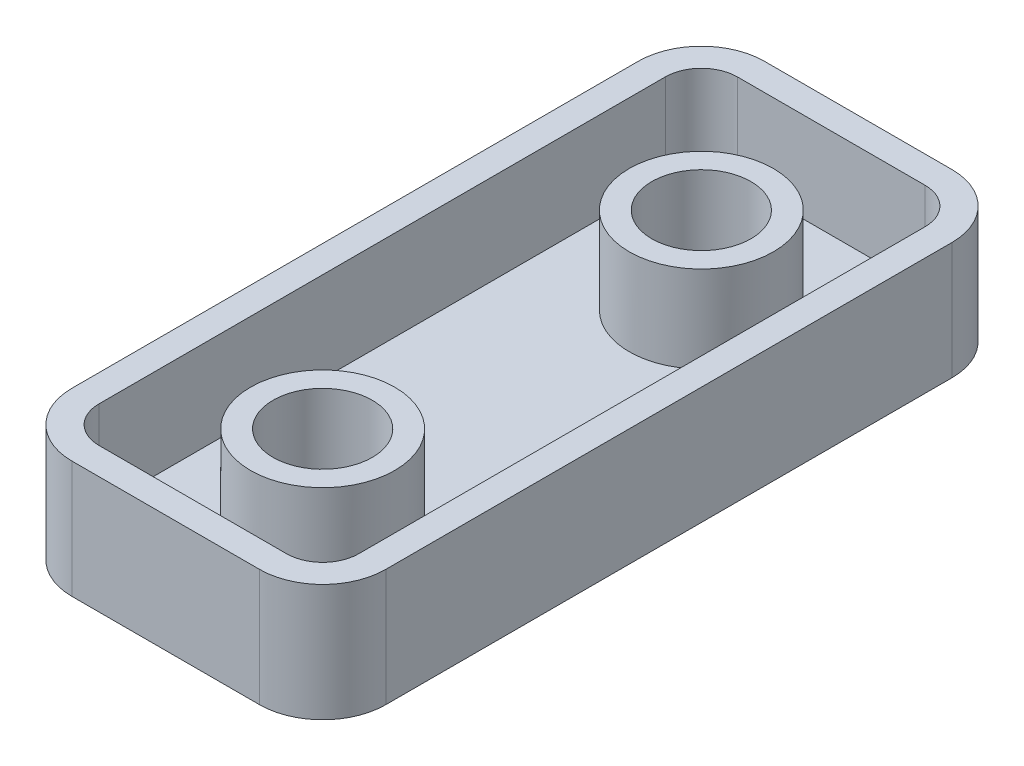
ISO-10303-21;
HEADER;
FILE_DESCRIPTION(('STEP AP214'),'2;1');
FILE_NAME('part.step','',(''),(''),'','','');
FILE_SCHEMA(('AUTOMOTIVE_DESIGN { 1 0 10303 214 1 1 1 1 }'));
ENDSEC;
DATA;
#1=APPLICATION_CONTEXT('core data for automotive mechanical design processes');
#2=APPLICATION_PROTOCOL_DEFINITION('international standard','automotive_design',2000,#1);
#3=PRODUCT_CONTEXT('',#1,'mechanical');
#4=PRODUCT('Part','Part','',(#3));
#5=PRODUCT_RELATED_PRODUCT_CATEGORY('part','',(#4));
#6=PRODUCT_DEFINITION_FORMATION('','',#4);
#7=PRODUCT_DEFINITION_CONTEXT('part definition',#1,'design');
#8=PRODUCT_DEFINITION('design','',#6,#7);
#9=PRODUCT_DEFINITION_SHAPE('','',#8);
#10=(LENGTH_UNIT() NAMED_UNIT(*) SI_UNIT(.MILLI.,.METRE.));
#11=(NAMED_UNIT(*) PLANE_ANGLE_UNIT() SI_UNIT($,.RADIAN.));
#12=(NAMED_UNIT(*) SI_UNIT($,.STERADIAN.) SOLID_ANGLE_UNIT());
#13=UNCERTAINTY_MEASURE_WITH_UNIT(LENGTH_MEASURE(1.E-05),#10,'distance_accuracy_value','');
#14=(GEOMETRIC_REPRESENTATION_CONTEXT(3) GLOBAL_UNCERTAINTY_ASSIGNED_CONTEXT((#13)) GLOBAL_UNIT_ASSIGNED_CONTEXT((#10,
#11,#12)) REPRESENTATION_CONTEXT('',''));
#15=CARTESIAN_POINT('',(0.,0.,0.));
#16=DIRECTION('',(0.,0.,1.));
#17=DIRECTION('',(1.,0.,0.));
#18=AXIS2_PLACEMENT_3D('',#15,#16,#17);
#19=CARTESIAN_POINT('',(0.,6.5,0.));
#20=DIRECTION('',(-1.,0.,0.));
#21=DIRECTION('',(0.,0.,1.));
#22=AXIS2_PLACEMENT_3D('',#19,#20,#21);
#23=PLANE('',#22);
#24=DIRECTION('',(0.,0.,-1.));
#25=VECTOR('',#24,1.);
#26=CARTESIAN_POINT('',(0.,0.,0.));
#27=LINE('',#26,#25);
#28=CARTESIAN_POINT('',(0.,0.,34.9));
#29=VERTEX_POINT('',#28);
#30=CARTESIAN_POINT('',(0.,0.,3.5));
#31=VERTEX_POINT('',#30);
#32=EDGE_CURVE('E219',#29,#31,#27,.T.);
#33=ORIENTED_EDGE('',*,*,#32,.T.);
#34=DIRECTION('',(0.,-1.,0.));
#35=VECTOR('',#34,1.);
#36=CARTESIAN_POINT('',(0.,6.5,3.5));
#37=LINE('',#36,#35);
#38=CARTESIAN_POINT('',(0.,6.5,3.5));
#39=VERTEX_POINT('',#38);
#40=EDGE_CURVE('E285',#31,#39,#37,.F.);
#41=ORIENTED_EDGE('',*,*,#40,.T.);
#42=DIRECTION('',(0.,0.,-1.));
#43=VECTOR('',#42,1.);
#44=CARTESIAN_POINT('',(0.,6.5,0.));
#45=LINE('',#44,#43);
#46=CARTESIAN_POINT('',(0.,6.5,34.9));
#47=VERTEX_POINT('',#46);
#48=EDGE_CURVE('E231',#47,#39,#45,.T.);
#49=ORIENTED_EDGE('',*,*,#48,.F.);
#50=DIRECTION('',(0.,-1.,0.));
#51=VECTOR('',#50,1.);
#52=CARTESIAN_POINT('',(0.,6.5,34.9));
#53=LINE('',#52,#51);
#54=EDGE_CURVE('E282',#47,#29,#53,.T.);
#55=ORIENTED_EDGE('',*,*,#54,.T.);
#56=EDGE_LOOP('',(#33,#41,#49,#55));
#57=FACE_BOUND('',#56,.T.);
#58=ADVANCED_FACE('F42',(#57),#23,.F.);
#59=CARTESIAN_POINT('',(0.,6.5,0.));
#60=DIRECTION('',(0.,0.,1.));
#61=DIRECTION('',(1.,0.,0.));
#62=AXIS2_PLACEMENT_3D('',#59,#60,#61);
#63=PLANE('',#62);
#64=DIRECTION('',(-1.,0.,0.));
#65=VECTOR('',#64,1.);
#66=CARTESIAN_POINT('',(0.,0.,0.));
#67=LINE('',#66,#65);
#68=CARTESIAN_POINT('',(-3.5,0.,0.));
#69=VERTEX_POINT('',#68);
#70=CARTESIAN_POINT('',(-13.9,0.,0.));
#71=VERTEX_POINT('',#70);
#72=EDGE_CURVE('E246',#69,#71,#67,.T.);
#73=ORIENTED_EDGE('',*,*,#72,.T.);
#74=DIRECTION('',(0.,-1.,0.));
#75=VECTOR('',#74,1.);
#76=CARTESIAN_POINT('',(-13.9,6.5,0.));
#77=LINE('',#76,#75);
#78=CARTESIAN_POINT('',(-13.9,6.5,0.));
#79=VERTEX_POINT('',#78);
#80=EDGE_CURVE('E65',#71,#79,#77,.F.);
#81=ORIENTED_EDGE('',*,*,#80,.T.);
#82=DIRECTION('',(-1.,0.,0.));
#83=VECTOR('',#82,1.);
#84=CARTESIAN_POINT('',(0.,6.5,0.));
#85=LINE('',#84,#83);
#86=CARTESIAN_POINT('',(-3.5,6.5,0.));
#87=VERTEX_POINT('',#86);
#88=EDGE_CURVE('E234',#87,#79,#85,.T.);
#89=ORIENTED_EDGE('',*,*,#88,.F.);
#90=DIRECTION('',(0.,-1.,0.));
#91=VECTOR('',#90,1.);
#92=CARTESIAN_POINT('',(-3.5,6.5,0.));
#93=LINE('',#92,#91);
#94=EDGE_CURVE('E278',#87,#69,#93,.T.);
#95=ORIENTED_EDGE('',*,*,#94,.T.);
#96=EDGE_LOOP('',(#73,#81,#89,#95));
#97=FACE_BOUND('',#96,.T.);
#98=ADVANCED_FACE('F306',(#97),#63,.F.);
#99=CARTESIAN_POINT('',(-17.4,6.5,0.));
#100=DIRECTION('',(1.,0.,0.));
#101=DIRECTION('',(0.,0.,-1.));
#102=AXIS2_PLACEMENT_3D('',#99,#100,#101);
#103=PLANE('',#102);
#104=DIRECTION('',(0.,0.,1.));
#105=VECTOR('',#104,1.);
#106=CARTESIAN_POINT('',(-17.4,0.,0.));
#107=LINE('',#106,#105);
#108=CARTESIAN_POINT('',(-17.4,0.,3.5));
#109=VERTEX_POINT('',#108);
#110=CARTESIAN_POINT('',(-17.4,0.,34.9));
#111=VERTEX_POINT('',#110);
#112=EDGE_CURVE('E248',#109,#111,#107,.T.);
#113=ORIENTED_EDGE('',*,*,#112,.T.);
#114=DIRECTION('',(0.,-1.,0.));
#115=VECTOR('',#114,1.);
#116=CARTESIAN_POINT('',(-17.4,6.5,34.9));
#117=LINE('',#116,#115);
#118=CARTESIAN_POINT('',(-17.4,6.5,34.9));
#119=VERTEX_POINT('',#118);
#120=EDGE_CURVE('E268',#111,#119,#117,.F.);
#121=ORIENTED_EDGE('',*,*,#120,.T.);
#122=DIRECTION('',(0.,0.,1.));
#123=VECTOR('',#122,1.);
#124=CARTESIAN_POINT('',(-17.4,6.5,0.));
#125=LINE('',#124,#123);
#126=CARTESIAN_POINT('',(-17.4,6.5,3.5));
#127=VERTEX_POINT('',#126);
#128=EDGE_CURVE('E237',#127,#119,#125,.T.);
#129=ORIENTED_EDGE('',*,*,#128,.F.);
#130=DIRECTION('',(0.,-1.,0.));
#131=VECTOR('',#130,1.);
#132=CARTESIAN_POINT('',(-17.4,6.5,3.5));
#133=LINE('',#132,#131);
#134=EDGE_CURVE('E265',#127,#109,#133,.T.);
#135=ORIENTED_EDGE('',*,*,#134,.T.);
#136=EDGE_LOOP('',(#113,#121,#129,#135));
#137=FACE_BOUND('',#136,.T.);
#138=ADVANCED_FACE('F312',(#137),#103,.F.);
#139=CARTESIAN_POINT('',(0.,6.5,38.4));
#140=DIRECTION('',(0.,0.,-1.));
#141=DIRECTION('',(-1.,0.,0.));
#142=AXIS2_PLACEMENT_3D('',#139,#140,#141);
#143=PLANE('',#142);
#144=DIRECTION('',(1.,0.,0.));
#145=VECTOR('',#144,1.);
#146=CARTESIAN_POINT('',(0.,6.5,38.4));
#147=LINE('',#146,#145);
#148=CARTESIAN_POINT('',(-13.9,6.5,38.4));
#149=VERTEX_POINT('',#148);
#150=CARTESIAN_POINT('',(-3.5,6.5,38.4));
#151=VERTEX_POINT('',#150);
#152=EDGE_CURVE('E240',#149,#151,#147,.T.);
#153=ORIENTED_EDGE('',*,*,#152,.F.);
#154=DIRECTION('',(0.,-1.,0.));
#155=VECTOR('',#154,1.);
#156=CARTESIAN_POINT('',(-13.9,6.5,38.4));
#157=LINE('',#156,#155);
#158=CARTESIAN_POINT('',(-13.9,0.,38.4));
#159=VERTEX_POINT('',#158);
#160=EDGE_CURVE('E254',#149,#159,#157,.T.);
#161=ORIENTED_EDGE('',*,*,#160,.T.);
#162=DIRECTION('',(1.,0.,0.));
#163=VECTOR('',#162,1.);
#164=CARTESIAN_POINT('',(0.,0.,38.4));
#165=LINE('',#164,#163);
#166=CARTESIAN_POINT('',(-3.5,0.,38.4));
#167=VERTEX_POINT('',#166);
#168=EDGE_CURVE('E235',#159,#167,#165,.T.);
#169=ORIENTED_EDGE('',*,*,#168,.T.);
#170=DIRECTION('',(0.,-1.,0.));
#171=VECTOR('',#170,1.);
#172=CARTESIAN_POINT('',(-3.5,6.5,38.4));
#173=LINE('',#172,#171);
#174=EDGE_CURVE('E243',#167,#151,#173,.F.);
#175=ORIENTED_EDGE('',*,*,#174,.T.);
#176=EDGE_LOOP('',(#153,#161,#169,#175));
#177=FACE_BOUND('',#176,.T.);
#178=ADVANCED_FACE('F351',(#177),#143,.F.);
#179=CARTESIAN_POINT('',(0.,6.5,0.));
#180=DIRECTION('',(0.,-1.,0.));
#181=DIRECTION('',(0.,0.,-1.));
#182=AXIS2_PLACEMENT_3D('',#179,#180,#181);
#183=PLANE('',#182);
#184=DIRECTION('',(1.,0.,0.));
#185=VECTOR('',#184,1.);
#186=CARTESIAN_POINT('',(-13.9,6.5,36.9));
#187=LINE('',#186,#185);
#188=CARTESIAN_POINT('',(-13.9,6.5,36.9));
#189=VERTEX_POINT('',#188);
#190=CARTESIAN_POINT('',(-3.5,6.5,36.9));
#191=VERTEX_POINT('',#190);
#192=EDGE_CURVE('E201',#189,#191,#187,.T.);
#193=ORIENTED_EDGE('',*,*,#192,.F.);
#194=CARTESIAN_POINT('',(-13.9,6.5,34.9));
#195=DIRECTION('',(0.,1.,0.));
#196=DIRECTION('',(0.,0.,-1.));
#197=AXIS2_PLACEMENT_3D('',#194,#195,#196);
#198=CIRCLE('',#197,2.);
#199=CARTESIAN_POINT('',(-15.9,6.5,34.9));
#200=VERTEX_POINT('',#199);
#201=EDGE_CURVE('E57',#200,#189,#198,.T.);
#202=ORIENTED_EDGE('',*,*,#201,.F.);
#203=DIRECTION('',(0.,0.,1.));
#204=VECTOR('',#203,1.);
#205=CARTESIAN_POINT('',(-15.9,6.5,34.9));
#206=LINE('',#205,#204);
#207=CARTESIAN_POINT('',(-15.9,6.5,3.5));
#208=VERTEX_POINT('',#207);
#209=EDGE_CURVE('E178',#208,#200,#206,.T.);
#210=ORIENTED_EDGE('',*,*,#209,.F.);
#211=CARTESIAN_POINT('',(-13.9,6.5,3.5));
#212=DIRECTION('',(0.,1.,0.));
#213=DIRECTION('',(0.,0.,1.));
#214=AXIS2_PLACEMENT_3D('',#211,#212,#213);
#215=CIRCLE('',#214,2.);
#216=CARTESIAN_POINT('',(-13.9,6.5,1.5));
#217=VERTEX_POINT('',#216);
#218=EDGE_CURVE('E181',#217,#208,#215,.T.);
#219=ORIENTED_EDGE('',*,*,#218,.F.);
#220=DIRECTION('',(-1.,0.,0.));
#221=VECTOR('',#220,1.);
#222=CARTESIAN_POINT('',(-13.9,6.5,1.5));
#223=LINE('',#222,#221);
#224=CARTESIAN_POINT('',(-3.50000000000001,6.5,1.5));
#225=VERTEX_POINT('',#224);
#226=EDGE_CURVE('E212',#225,#217,#223,.T.);
#227=ORIENTED_EDGE('',*,*,#226,.F.);
#228=CARTESIAN_POINT('',(-3.5,6.5,3.5));
#229=DIRECTION('',(0.,1.,0.));
#230=DIRECTION('',(0.,0.,1.));
#231=AXIS2_PLACEMENT_3D('',#228,#229,#230);
#232=CIRCLE('',#231,2.);
#233=CARTESIAN_POINT('',(-1.5,6.5,3.50000000000001));
#234=VERTEX_POINT('',#233);
#235=EDGE_CURVE('E209',#234,#225,#232,.T.);
#236=ORIENTED_EDGE('',*,*,#235,.F.);
#237=DIRECTION('',(0.,0.,-1.));
#238=VECTOR('',#237,1.);
#239=CARTESIAN_POINT('',(-1.5,6.5,34.9));
#240=LINE('',#239,#238);
#241=CARTESIAN_POINT('',(-1.5,6.5,34.9));
#242=VERTEX_POINT('',#241);
#243=EDGE_CURVE('E206',#242,#234,#240,.T.);
#244=ORIENTED_EDGE('',*,*,#243,.F.);
#245=CARTESIAN_POINT('',(-3.5,6.5,34.9));
#246=DIRECTION('',(0.,1.,0.));
#247=DIRECTION('',(0.,0.,1.));
#248=AXIS2_PLACEMENT_3D('',#245,#246,#247);
#249=CIRCLE('',#248,2.);
#250=EDGE_CURVE('E203',#191,#242,#249,.T.);
#251=ORIENTED_EDGE('',*,*,#250,.F.);
#252=EDGE_LOOP('',(#193,#202,#210,#219,#227,#236,#244,#251));
#253=FACE_BOUND('',#252,.T.);
#254=ORIENTED_EDGE('',*,*,#128,.T.);
#255=CARTESIAN_POINT('',(-13.9,6.5,34.9));
#256=DIRECTION('',(0.,-1.,0.));
#257=DIRECTION('',(0.,0.,-1.));
#258=AXIS2_PLACEMENT_3D('',#255,#256,#257);
#259=CIRCLE('',#258,3.5);
#260=EDGE_CURVE('E276',#119,#149,#259,.F.);
#261=ORIENTED_EDGE('',*,*,#260,.T.);
#262=ORIENTED_EDGE('',*,*,#152,.T.);
#263=CARTESIAN_POINT('',(-3.5,6.5,34.9));
#264=DIRECTION('',(0.,-1.,0.));
#265=DIRECTION('',(0.,0.,-1.));
#266=AXIS2_PLACEMENT_3D('',#263,#264,#265);
#267=CIRCLE('',#266,3.5);
#268=EDGE_CURVE('E270',#151,#47,#267,.F.);
#269=ORIENTED_EDGE('',*,*,#268,.T.);
#270=ORIENTED_EDGE('',*,*,#48,.T.);
#271=CARTESIAN_POINT('',(-3.5,6.5,3.5));
#272=DIRECTION('',(0.,-1.,0.));
#273=DIRECTION('',(0.,0.,-1.));
#274=AXIS2_PLACEMENT_3D('',#271,#272,#273);
#275=CIRCLE('',#274,3.5);
#276=EDGE_CURVE('E272',#39,#87,#275,.F.);
#277=ORIENTED_EDGE('',*,*,#276,.T.);
#278=ORIENTED_EDGE('',*,*,#88,.T.);
#279=CARTESIAN_POINT('',(-13.9,6.5,3.5));
#280=DIRECTION('',(0.,-1.,0.));
#281=DIRECTION('',(0.,0.,-1.));
#282=AXIS2_PLACEMENT_3D('',#279,#280,#281);
#283=CIRCLE('',#282,3.5);
#284=EDGE_CURVE('E274',#79,#127,#283,.F.);
#285=ORIENTED_EDGE('',*,*,#284,.T.);
#286=EDGE_LOOP('',(#254,#261,#262,#269,#270,#277,#278,#285));
#287=FACE_BOUND('',#286,.T.);
#288=ADVANCED_FACE('F335',(#253,#287),#183,.F.);
#289=CARTESIAN_POINT('',(0.,0.,0.));
#290=DIRECTION('',(0.,-1.,0.));
#291=DIRECTION('',(0.,0.,-1.));
#292=AXIS2_PLACEMENT_3D('',#289,#290,#291);
#293=PLANE('',#292);
#294=ORIENTED_EDGE('',*,*,#168,.F.);
#295=CARTESIAN_POINT('',(-13.9,0.,34.9));
#296=DIRECTION('',(0.,-1.,0.));
#297=DIRECTION('',(0.,0.,-1.));
#298=AXIS2_PLACEMENT_3D('',#295,#296,#297);
#299=CIRCLE('',#298,3.5);
#300=EDGE_CURVE('E263',#159,#111,#299,.T.);
#301=ORIENTED_EDGE('',*,*,#300,.T.);
#302=ORIENTED_EDGE('',*,*,#112,.F.);
#303=CARTESIAN_POINT('',(-13.9,0.,3.5));
#304=DIRECTION('',(0.,-1.,0.));
#305=DIRECTION('',(0.,0.,-1.));
#306=AXIS2_PLACEMENT_3D('',#303,#304,#305);
#307=CIRCLE('',#306,3.5);
#308=EDGE_CURVE('E261',#109,#71,#307,.T.);
#309=ORIENTED_EDGE('',*,*,#308,.T.);
#310=ORIENTED_EDGE('',*,*,#72,.F.);
#311=CARTESIAN_POINT('',(-3.5,0.,3.5));
#312=DIRECTION('',(0.,-1.,0.));
#313=DIRECTION('',(0.,0.,-1.));
#314=AXIS2_PLACEMENT_3D('',#311,#312,#313);
#315=CIRCLE('',#314,3.5);
#316=EDGE_CURVE('E259',#69,#31,#315,.T.);
#317=ORIENTED_EDGE('',*,*,#316,.T.);
#318=ORIENTED_EDGE('',*,*,#32,.F.);
#319=CARTESIAN_POINT('',(-3.5,0.,34.9));
#320=DIRECTION('',(0.,-1.,0.));
#321=DIRECTION('',(0.,0.,-1.));
#322=AXIS2_PLACEMENT_3D('',#319,#320,#321);
#323=CIRCLE('',#322,3.5);
#324=EDGE_CURVE('E257',#29,#167,#323,.T.);
#325=ORIENTED_EDGE('',*,*,#324,.T.);
#326=EDGE_LOOP('',(#294,#301,#302,#309,#310,#317,#318,#325));
#327=FACE_BOUND('',#326,.T.);
#328=ADVANCED_FACE('F320',(#327),#293,.T.);
#329=CARTESIAN_POINT('',(-13.9,6.5,34.9));
#330=DIRECTION('',(0.,-1.,0.));
#331=DIRECTION('',(0.,0.,-1.));
#332=AXIS2_PLACEMENT_3D('',#329,#330,#331);
#333=CYLINDRICAL_SURFACE('',#332,3.5);
#334=ORIENTED_EDGE('',*,*,#260,.F.);
#335=ORIENTED_EDGE('',*,*,#120,.F.);
#336=ORIENTED_EDGE('',*,*,#300,.F.);
#337=ORIENTED_EDGE('',*,*,#160,.F.);
#338=EDGE_LOOP('',(#334,#335,#336,#337));
#339=FACE_BOUND('',#338,.T.);
#340=ADVANCED_FACE('F316',(#339),#333,.T.);
#341=CARTESIAN_POINT('',(-13.9,6.5,3.5));
#342=DIRECTION('',(0.,-1.,0.));
#343=DIRECTION('',(0.,0.,-1.));
#344=AXIS2_PLACEMENT_3D('',#341,#342,#343);
#345=CYLINDRICAL_SURFACE('',#344,3.5);
#346=ORIENTED_EDGE('',*,*,#284,.F.);
#347=ORIENTED_EDGE('',*,*,#80,.F.);
#348=ORIENTED_EDGE('',*,*,#308,.F.);
#349=ORIENTED_EDGE('',*,*,#134,.F.);
#350=EDGE_LOOP('',(#346,#347,#348,#349));
#351=FACE_BOUND('',#350,.T.);
#352=ADVANCED_FACE('F319',(#351),#345,.T.);
#353=CARTESIAN_POINT('',(-3.5,6.5,3.5));
#354=DIRECTION('',(0.,-1.,0.));
#355=DIRECTION('',(0.,0.,-1.));
#356=AXIS2_PLACEMENT_3D('',#353,#354,#355);
#357=CYLINDRICAL_SURFACE('',#356,3.5);
#358=ORIENTED_EDGE('',*,*,#276,.F.);
#359=ORIENTED_EDGE('',*,*,#40,.F.);
#360=ORIENTED_EDGE('',*,*,#316,.F.);
#361=ORIENTED_EDGE('',*,*,#94,.F.);
#362=EDGE_LOOP('',(#358,#359,#360,#361));
#363=FACE_BOUND('',#362,.T.);
#364=ADVANCED_FACE('F323',(#363),#357,.T.);
#365=CARTESIAN_POINT('',(-3.5,6.5,34.9));
#366=DIRECTION('',(0.,-1.,0.));
#367=DIRECTION('',(0.,0.,-1.));
#368=AXIS2_PLACEMENT_3D('',#365,#366,#367);
#369=CYLINDRICAL_SURFACE('',#368,3.5);
#370=ORIENTED_EDGE('',*,*,#268,.F.);
#371=ORIENTED_EDGE('',*,*,#174,.F.);
#372=ORIENTED_EDGE('',*,*,#324,.F.);
#373=ORIENTED_EDGE('',*,*,#54,.F.);
#374=EDGE_LOOP('',(#370,#371,#372,#373));
#375=FACE_BOUND('',#374,.T.);
#376=ADVANCED_FACE('F44',(#375),#369,.T.);
#377=CARTESIAN_POINT('',(-13.9,1.5,34.9));
#378=DIRECTION('',(0.,1.,0.));
#379=DIRECTION('',(0.,0.,1.));
#380=AXIS2_PLACEMENT_3D('',#377,#378,#379);
#381=CYLINDRICAL_SURFACE('',#380,2.);
#382=ORIENTED_EDGE('',*,*,#201,.T.);
#383=DIRECTION('',(0.,1.,0.));
#384=VECTOR('',#383,1.);
#385=CARTESIAN_POINT('',(-13.9,1.5,36.9));
#386=LINE('',#385,#384);
#387=CARTESIAN_POINT('',(-13.9,1.5,36.9));
#388=VERTEX_POINT('',#387);
#389=EDGE_CURVE('E155',#388,#189,#386,.T.);
#390=ORIENTED_EDGE('',*,*,#389,.F.);
#391=CARTESIAN_POINT('',(-13.9,1.5,34.9));
#392=DIRECTION('',(0.,1.,0.));
#393=DIRECTION('',(0.,0.,-1.));
#394=AXIS2_PLACEMENT_3D('',#391,#392,#393);
#395=CIRCLE('',#394,2.);
#396=CARTESIAN_POINT('',(-15.9,1.5,34.9));
#397=VERTEX_POINT('',#396);
#398=EDGE_CURVE('E159',#397,#388,#395,.T.);
#399=ORIENTED_EDGE('',*,*,#398,.F.);
#400=DIRECTION('',(0.,1.,0.));
#401=VECTOR('',#400,1.);
#402=CARTESIAN_POINT('',(-15.9,1.5,34.9));
#403=LINE('',#402,#401);
#404=EDGE_CURVE('E217',#397,#200,#403,.T.);
#405=ORIENTED_EDGE('',*,*,#404,.T.);
#406=EDGE_LOOP('',(#382,#390,#399,#405));
#407=FACE_BOUND('',#406,.T.);
#408=ADVANCED_FACE('F157',(#407),#381,.F.);
#409=CARTESIAN_POINT('',(-15.9,1.5,34.9));
#410=DIRECTION('',(-1.,0.,0.));
#411=DIRECTION('',(0.,0.,1.));
#412=AXIS2_PLACEMENT_3D('',#409,#410,#411);
#413=PLANE('',#412);
#414=ORIENTED_EDGE('',*,*,#209,.T.);
#415=ORIENTED_EDGE('',*,*,#404,.F.);
#416=DIRECTION('',(0.,0.,1.));
#417=VECTOR('',#416,1.);
#418=CARTESIAN_POINT('',(-15.9,1.5,34.9));
#419=LINE('',#418,#417);
#420=CARTESIAN_POINT('',(-15.9,1.5,3.5));
#421=VERTEX_POINT('',#420);
#422=EDGE_CURVE('E165',#421,#397,#419,.T.);
#423=ORIENTED_EDGE('',*,*,#422,.F.);
#424=DIRECTION('',(0.,1.,0.));
#425=VECTOR('',#424,1.);
#426=CARTESIAN_POINT('',(-15.9,1.5,3.5));
#427=LINE('',#426,#425);
#428=EDGE_CURVE('E220',#421,#208,#427,.T.);
#429=ORIENTED_EDGE('',*,*,#428,.T.);
#430=EDGE_LOOP('',(#414,#415,#423,#429));
#431=FACE_BOUND('',#430,.T.);
#432=ADVANCED_FACE('F367',(#431),#413,.F.);
#433=CARTESIAN_POINT('',(-13.9,1.5,3.5));
#434=DIRECTION('',(0.,1.,0.));
#435=DIRECTION('',(0.,0.,1.));
#436=AXIS2_PLACEMENT_3D('',#433,#434,#435);
#437=CYLINDRICAL_SURFACE('',#436,2.);
#438=ORIENTED_EDGE('',*,*,#218,.T.);
#439=ORIENTED_EDGE('',*,*,#428,.F.);
#440=CARTESIAN_POINT('',(-13.9,1.5,3.5));
#441=DIRECTION('',(0.,1.,0.));
#442=DIRECTION('',(0.,0.,1.));
#443=AXIS2_PLACEMENT_3D('',#440,#441,#442);
#444=CIRCLE('',#443,2.);
#445=CARTESIAN_POINT('',(-13.9,1.5,1.5));
#446=VERTEX_POINT('',#445);
#447=EDGE_CURVE('E197',#446,#421,#444,.T.);
#448=ORIENTED_EDGE('',*,*,#447,.F.);
#449=DIRECTION('',(0.,1.,0.));
#450=VECTOR('',#449,1.);
#451=CARTESIAN_POINT('',(-13.9,1.5,1.5));
#452=LINE('',#451,#450);
#453=EDGE_CURVE('E222',#446,#217,#452,.T.);
#454=ORIENTED_EDGE('',*,*,#453,.T.);
#455=EDGE_LOOP('',(#438,#439,#448,#454));
#456=FACE_BOUND('',#455,.T.);
#457=ADVANCED_FACE('F383',(#456),#437,.F.);
#458=CARTESIAN_POINT('',(-13.9,1.5,1.5));
#459=DIRECTION('',(0.,0.,-1.));
#460=DIRECTION('',(-1.,0.,0.));
#461=AXIS2_PLACEMENT_3D('',#458,#459,#460);
#462=PLANE('',#461);
#463=ORIENTED_EDGE('',*,*,#226,.T.);
#464=ORIENTED_EDGE('',*,*,#453,.F.);
#465=DIRECTION('',(-1.,0.,0.));
#466=VECTOR('',#465,1.);
#467=CARTESIAN_POINT('',(-13.9,1.5,1.5));
#468=LINE('',#467,#466);
#469=CARTESIAN_POINT('',(-3.50000000000001,1.5,1.5));
#470=VERTEX_POINT('',#469);
#471=EDGE_CURVE('E194',#470,#446,#468,.T.);
#472=ORIENTED_EDGE('',*,*,#471,.F.);
#473=DIRECTION('',(0.,1.,0.));
#474=VECTOR('',#473,1.);
#475=CARTESIAN_POINT('',(-3.50000000000001,1.5,1.5));
#476=LINE('',#475,#474);
#477=EDGE_CURVE('E224',#470,#225,#476,.T.);
#478=ORIENTED_EDGE('',*,*,#477,.T.);
#479=EDGE_LOOP('',(#463,#464,#472,#478));
#480=FACE_BOUND('',#479,.T.);
#481=ADVANCED_FACE('F379',(#480),#462,.F.);
#482=CARTESIAN_POINT('',(-3.5,1.5,3.5));
#483=DIRECTION('',(0.,1.,0.));
#484=DIRECTION('',(0.,0.,1.));
#485=AXIS2_PLACEMENT_3D('',#482,#483,#484);
#486=CYLINDRICAL_SURFACE('',#485,2.);
#487=ORIENTED_EDGE('',*,*,#235,.T.);
#488=ORIENTED_EDGE('',*,*,#477,.F.);
#489=CARTESIAN_POINT('',(-3.5,1.5,3.5));
#490=DIRECTION('',(0.,1.,0.));
#491=DIRECTION('',(0.,0.,1.));
#492=AXIS2_PLACEMENT_3D('',#489,#490,#491);
#493=CIRCLE('',#492,2.);
#494=CARTESIAN_POINT('',(-1.5,1.5,3.50000000000001));
#495=VERTEX_POINT('',#494);
#496=EDGE_CURVE('E191',#495,#470,#493,.T.);
#497=ORIENTED_EDGE('',*,*,#496,.F.);
#498=DIRECTION('',(0.,1.,0.));
#499=VECTOR('',#498,1.);
#500=CARTESIAN_POINT('',(-1.5,1.5,3.50000000000001));
#501=LINE('',#500,#499);
#502=EDGE_CURVE('E226',#495,#234,#501,.T.);
#503=ORIENTED_EDGE('',*,*,#502,.T.);
#504=EDGE_LOOP('',(#487,#488,#497,#503));
#505=FACE_BOUND('',#504,.T.);
#506=ADVANCED_FACE('F375',(#505),#486,.F.);
#507=CARTESIAN_POINT('',(-1.5,1.5,34.9));
#508=DIRECTION('',(1.,0.,0.));
#509=DIRECTION('',(0.,0.,-1.));
#510=AXIS2_PLACEMENT_3D('',#507,#508,#509);
#511=PLANE('',#510);
#512=ORIENTED_EDGE('',*,*,#243,.T.);
#513=ORIENTED_EDGE('',*,*,#502,.F.);
#514=DIRECTION('',(0.,0.,-1.));
#515=VECTOR('',#514,1.);
#516=CARTESIAN_POINT('',(-1.5,1.5,34.9));
#517=LINE('',#516,#515);
#518=CARTESIAN_POINT('',(-1.5,1.5,34.9));
#519=VERTEX_POINT('',#518);
#520=EDGE_CURVE('E188',#519,#495,#517,.T.);
#521=ORIENTED_EDGE('',*,*,#520,.F.);
#522=DIRECTION('',(0.,1.,0.));
#523=VECTOR('',#522,1.);
#524=CARTESIAN_POINT('',(-1.5,1.5,34.9));
#525=LINE('',#524,#523);
#526=EDGE_CURVE('E228',#519,#242,#525,.T.);
#527=ORIENTED_EDGE('',*,*,#526,.T.);
#528=EDGE_LOOP('',(#512,#513,#521,#527));
#529=FACE_BOUND('',#528,.T.);
#530=ADVANCED_FACE('F371',(#529),#511,.F.);
#531=CARTESIAN_POINT('',(-3.5,1.5,34.9));
#532=DIRECTION('',(0.,1.,0.));
#533=DIRECTION('',(0.,0.,1.));
#534=AXIS2_PLACEMENT_3D('',#531,#532,#533);
#535=CYLINDRICAL_SURFACE('',#534,2.);
#536=ORIENTED_EDGE('',*,*,#250,.T.);
#537=ORIENTED_EDGE('',*,*,#526,.F.);
#538=CARTESIAN_POINT('',(-3.5,1.5,34.9));
#539=DIRECTION('',(0.,1.,0.));
#540=DIRECTION('',(0.,0.,1.));
#541=AXIS2_PLACEMENT_3D('',#538,#539,#540);
#542=CIRCLE('',#541,2.);
#543=CARTESIAN_POINT('',(-3.5,1.5,36.9));
#544=VERTEX_POINT('',#543);
#545=EDGE_CURVE('E173',#544,#519,#542,.T.);
#546=ORIENTED_EDGE('',*,*,#545,.F.);
#547=DIRECTION('',(0.,1.,0.));
#548=VECTOR('',#547,1.);
#549=CARTESIAN_POINT('',(-3.5,1.5,36.9));
#550=LINE('',#549,#548);
#551=EDGE_CURVE('E164',#544,#191,#550,.T.);
#552=ORIENTED_EDGE('',*,*,#551,.T.);
#553=EDGE_LOOP('',(#536,#537,#546,#552));
#554=FACE_BOUND('',#553,.T.);
#555=ADVANCED_FACE('F301',(#554),#535,.F.);
#556=CARTESIAN_POINT('',(-13.9,1.5,36.9));
#557=DIRECTION('',(0.,0.,1.));
#558=DIRECTION('',(1.,0.,0.));
#559=AXIS2_PLACEMENT_3D('',#556,#557,#558);
#560=PLANE('',#559);
#561=ORIENTED_EDGE('',*,*,#192,.T.);
#562=ORIENTED_EDGE('',*,*,#551,.F.);
#563=DIRECTION('',(1.,0.,0.));
#564=VECTOR('',#563,1.);
#565=CARTESIAN_POINT('',(-13.9,1.5,36.9));
#566=LINE('',#565,#564);
#567=EDGE_CURVE('E168',#388,#544,#566,.T.);
#568=ORIENTED_EDGE('',*,*,#567,.F.);
#569=ORIENTED_EDGE('',*,*,#389,.T.);
#570=EDGE_LOOP('',(#561,#562,#568,#569));
#571=FACE_BOUND('',#570,.T.);
#572=ADVANCED_FACE('F169',(#571),#560,.F.);
#573=CARTESIAN_POINT('',(-13.9,1.5,34.9));
#574=DIRECTION('',(0.,-1.,0.));
#575=DIRECTION('',(0.,0.,-1.));
#576=AXIS2_PLACEMENT_3D('',#573,#574,#575);
#577=PLANE('',#576);
#578=CARTESIAN_POINT('',(-8.7,1.5,29.7));
#579=DIRECTION('',(0.,-1.,0.));
#580=DIRECTION('',(0.,0.,-1.));
#581=AXIS2_PLACEMENT_3D('',#578,#579,#580);
#582=CIRCLE('',#581,4.);
#583=CARTESIAN_POINT('',(-8.7,1.5,25.7));
#584=VERTEX_POINT('',#583);
#585=EDGE_CURVE('E11',#584,#584,#582,.F.);
#586=ORIENTED_EDGE('',*,*,#585,.F.);
#587=EDGE_LOOP('',(#586));
#588=FACE_BOUND('',#587,.T.);
#589=CARTESIAN_POINT('',(-8.7,1.5,8.7));
#590=DIRECTION('',(0.,-1.,0.));
#591=DIRECTION('',(0.,0.,-1.));
#592=AXIS2_PLACEMENT_3D('',#589,#590,#591);
#593=CIRCLE('',#592,4.);
#594=CARTESIAN_POINT('',(-8.7,1.5,4.69999999999999));
#595=VERTEX_POINT('',#594);
#596=EDGE_CURVE('E50',#595,#595,#593,.F.);
#597=ORIENTED_EDGE('',*,*,#596,.F.);
#598=EDGE_LOOP('',(#597));
#599=FACE_BOUND('',#598,.T.);
#600=ORIENTED_EDGE('',*,*,#398,.T.);
#601=ORIENTED_EDGE('',*,*,#567,.T.);
#602=ORIENTED_EDGE('',*,*,#545,.T.);
#603=ORIENTED_EDGE('',*,*,#520,.T.);
#604=ORIENTED_EDGE('',*,*,#496,.T.);
#605=ORIENTED_EDGE('',*,*,#471,.T.);
#606=ORIENTED_EDGE('',*,*,#447,.T.);
#607=ORIENTED_EDGE('',*,*,#422,.T.);
#608=EDGE_LOOP('',(#600,#601,#602,#603,#604,#605,#606,#607));
#609=FACE_BOUND('',#608,.T.);
#610=ADVANCED_FACE('F175',(#588,#599,#609),#577,.F.);
#611=CARTESIAN_POINT('',(-8.7,6.3,8.7));
#612=DIRECTION('',(0.,-1.,0.));
#613=DIRECTION('',(0.,0.,-1.));
#614=AXIS2_PLACEMENT_3D('',#611,#612,#613);
#615=CYLINDRICAL_SURFACE('',#614,2.75);
#616=CARTESIAN_POINT('',(-8.7,6.3,8.7));
#617=DIRECTION('',(0.,1.,0.));
#618=DIRECTION('',(0.,0.,1.));
#619=AXIS2_PLACEMENT_3D('',#616,#617,#618);
#620=CIRCLE('',#619,2.75);
#621=CARTESIAN_POINT('',(-8.7,6.3,11.45));
#622=VERTEX_POINT('',#621);
#623=EDGE_CURVE('E708',#622,#622,#620,.T.);
#624=ORIENTED_EDGE('',*,*,#623,.T.);
#625=EDGE_LOOP('',(#624));
#626=FACE_BOUND('',#625,.T.);
#627=CARTESIAN_POINT('',(-8.7,0.6,8.7));
#628=DIRECTION('',(0.,1.,0.));
#629=DIRECTION('',(0.,0.,1.));
#630=AXIS2_PLACEMENT_3D('',#627,#628,#629);
#631=CIRCLE('',#630,2.75);
#632=CARTESIAN_POINT('',(-8.7,0.6,11.45));
#633=VERTEX_POINT('',#632);
#634=EDGE_CURVE('E696',#633,#633,#631,.T.);
#635=ORIENTED_EDGE('',*,*,#634,.F.);
#636=EDGE_LOOP('',(#635));
#637=FACE_BOUND('',#636,.T.);
#638=ADVANCED_FACE('F292',(#626,#637),#615,.F.);
#639=CARTESIAN_POINT('',(-8.7,6.3,8.7));
#640=DIRECTION('',(0.,-1.,0.));
#641=DIRECTION('',(0.,0.,-1.));
#642=AXIS2_PLACEMENT_3D('',#639,#640,#641);
#643=CYLINDRICAL_SURFACE('',#642,4.);
#644=CARTESIAN_POINT('',(-8.7,6.3,8.7));
#645=DIRECTION('',(0.,1.,0.));
#646=DIRECTION('',(0.,0.,1.));
#647=AXIS2_PLACEMENT_3D('',#644,#645,#646);
#648=CIRCLE('',#647,4.);
#649=CARTESIAN_POINT('',(-8.7,6.3,12.7));
#650=VERTEX_POINT('',#649);
#651=EDGE_CURVE('E184',#650,#650,#648,.T.);
#652=ORIENTED_EDGE('',*,*,#651,.F.);
#653=EDGE_LOOP('',(#652));
#654=FACE_BOUND('',#653,.T.);
#655=ORIENTED_EDGE('',*,*,#596,.T.);
#656=EDGE_LOOP('',(#655));
#657=FACE_BOUND('',#656,.T.);
#658=ADVANCED_FACE('F289',(#654,#657),#643,.T.);
#659=CARTESIAN_POINT('',(0.,6.3,0.));
#660=DIRECTION('',(0.,1.,0.));
#661=DIRECTION('',(0.,0.,1.));
#662=AXIS2_PLACEMENT_3D('',#659,#660,#661);
#663=PLANE('',#662);
#664=ORIENTED_EDGE('',*,*,#623,.F.);
#665=EDGE_LOOP('',(#664));
#666=FACE_BOUND('',#665,.T.);
#667=ORIENTED_EDGE('',*,*,#651,.T.);
#668=EDGE_LOOP('',(#667));
#669=FACE_BOUND('',#668,.T.);
#670=ADVANCED_FACE('F448',(#666,#669),#663,.T.);
#671=CARTESIAN_POINT('',(-8.7,6.3,29.7));
#672=DIRECTION('',(0.,-1.,0.));
#673=DIRECTION('',(0.,0.,-1.));
#674=AXIS2_PLACEMENT_3D('',#671,#672,#673);
#675=CYLINDRICAL_SURFACE('',#674,2.75);
#676=CARTESIAN_POINT('',(-8.7,6.3,29.7));
#677=DIRECTION('',(0.,1.,0.));
#678=DIRECTION('',(0.,0.,1.));
#679=AXIS2_PLACEMENT_3D('',#676,#677,#678);
#680=CIRCLE('',#679,2.75);
#681=CARTESIAN_POINT('',(-8.7,6.3,32.45));
#682=VERTEX_POINT('',#681);
#683=EDGE_CURVE('E701',#682,#682,#680,.T.);
#684=ORIENTED_EDGE('',*,*,#683,.T.);
#685=EDGE_LOOP('',(#684));
#686=FACE_BOUND('',#685,.T.);
#687=CARTESIAN_POINT('',(-8.7,0.6,29.7));
#688=DIRECTION('',(0.,1.,0.));
#689=DIRECTION('',(0.,0.,1.));
#690=AXIS2_PLACEMENT_3D('',#687,#688,#689);
#691=CIRCLE('',#690,2.75);
#692=CARTESIAN_POINT('',(-8.7,0.6,32.45));
#693=VERTEX_POINT('',#692);
#694=EDGE_CURVE('E698',#693,#693,#691,.T.);
#695=ORIENTED_EDGE('',*,*,#694,.F.);
#696=EDGE_LOOP('',(#695));
#697=FACE_BOUND('',#696,.T.);
#698=ADVANCED_FACE('F458',(#686,#697),#675,.F.);
#699=CARTESIAN_POINT('',(-8.7,6.3,29.7));
#700=DIRECTION('',(0.,-1.,0.));
#701=DIRECTION('',(0.,0.,-1.));
#702=AXIS2_PLACEMENT_3D('',#699,#700,#701);
#703=CYLINDRICAL_SURFACE('',#702,4.);
#704=CARTESIAN_POINT('',(-8.7,6.3,29.7));
#705=DIRECTION('',(0.,1.,0.));
#706=DIRECTION('',(0.,0.,1.));
#707=AXIS2_PLACEMENT_3D('',#704,#705,#706);
#708=CIRCLE('',#707,4.);
#709=CARTESIAN_POINT('',(-8.7,6.3,33.7));
#710=VERTEX_POINT('',#709);
#711=EDGE_CURVE('E706',#710,#710,#708,.T.);
#712=ORIENTED_EDGE('',*,*,#711,.F.);
#713=EDGE_LOOP('',(#712));
#714=FACE_BOUND('',#713,.T.);
#715=ORIENTED_EDGE('',*,*,#585,.T.);
#716=EDGE_LOOP('',(#715));
#717=FACE_BOUND('',#716,.T.);
#718=ADVANCED_FACE('F468',(#714,#717),#703,.T.);
#719=CARTESIAN_POINT('',(0.,6.3,0.));
#720=DIRECTION('',(0.,1.,0.));
#721=DIRECTION('',(0.,0.,1.));
#722=AXIS2_PLACEMENT_3D('',#719,#720,#721);
#723=PLANE('',#722);
#724=ORIENTED_EDGE('',*,*,#683,.F.);
#725=EDGE_LOOP('',(#724));
#726=FACE_BOUND('',#725,.T.);
#727=ORIENTED_EDGE('',*,*,#711,.T.);
#728=EDGE_LOOP('',(#727));
#729=FACE_BOUND('',#728,.T.);
#730=ADVANCED_FACE('F478',(#726,#729),#723,.T.);
#731=CARTESIAN_POINT('',(-8.7,0.6,29.7));
#732=DIRECTION('',(0.,1.,0.));
#733=DIRECTION('',(0.,0.,1.));
#734=AXIS2_PLACEMENT_3D('',#731,#732,#733);
#735=PLANE('',#734);
#736=ORIENTED_EDGE('',*,*,#694,.T.);
#737=EDGE_LOOP('',(#736));
#738=FACE_BOUND('',#737,.T.);
#739=ADVANCED_FACE('F487',(#738),#735,.T.);
#740=CARTESIAN_POINT('',(-8.7,0.6,8.7));
#741=DIRECTION('',(0.,1.,0.));
#742=DIRECTION('',(0.,0.,1.));
#743=AXIS2_PLACEMENT_3D('',#740,#741,#742);
#744=PLANE('',#743);
#745=ORIENTED_EDGE('',*,*,#634,.T.);
#746=EDGE_LOOP('',(#745));
#747=FACE_BOUND('',#746,.T.);
#748=ADVANCED_FACE('F496',(#747),#744,.T.);
#749=CLOSED_SHELL('',(#58,#98,#138,#178,#288,#328,#340,#352,#364,#376,#408,#432,#457,#481,#506,
#530,#555,#572,#610,#638,#658,#670,#698,#718,#730,#739,#748));
#750=MANIFOLD_SOLID_BREP('B2',#749);
#751=ADVANCED_BREP_SHAPE_REPRESENTATION('',(#18,#750),#14);
#752=SHAPE_DEFINITION_REPRESENTATION(#9,#751);
ENDSEC;
END-ISO-10303-21;
